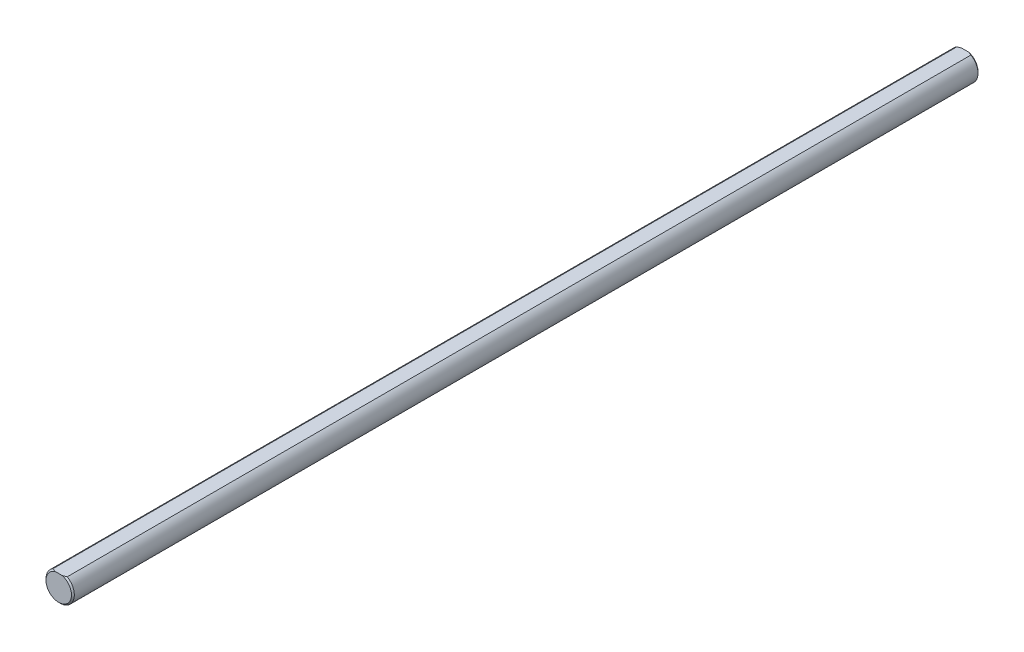
ISO-10303-21;
HEADER;
FILE_DESCRIPTION(('STEP AP214'),'2;1');
FILE_NAME('part.step','',(''),(''),'','','');
FILE_SCHEMA(('AUTOMOTIVE_DESIGN { 1 0 10303 214 1 1 1 1 }'));
ENDSEC;
DATA;
#1=APPLICATION_CONTEXT('core data for automotive mechanical design processes');
#2=APPLICATION_PROTOCOL_DEFINITION('international standard','automotive_design',2000,#1);
#3=PRODUCT_CONTEXT('',#1,'mechanical');
#4=PRODUCT('Part','Part','',(#3));
#5=PRODUCT_RELATED_PRODUCT_CATEGORY('part','',(#4));
#6=PRODUCT_DEFINITION_FORMATION('','',#4);
#7=PRODUCT_DEFINITION_CONTEXT('part definition',#1,'design');
#8=PRODUCT_DEFINITION('design','',#6,#7);
#9=PRODUCT_DEFINITION_SHAPE('','',#8);
#10=(LENGTH_UNIT() NAMED_UNIT(*) SI_UNIT(.MILLI.,.METRE.));
#11=(NAMED_UNIT(*) PLANE_ANGLE_UNIT() SI_UNIT($,.RADIAN.));
#12=(NAMED_UNIT(*) SI_UNIT($,.STERADIAN.) SOLID_ANGLE_UNIT());
#13=UNCERTAINTY_MEASURE_WITH_UNIT(LENGTH_MEASURE(1.E-05),#10,'distance_accuracy_value','');
#14=(GEOMETRIC_REPRESENTATION_CONTEXT(3) GLOBAL_UNCERTAINTY_ASSIGNED_CONTEXT((#13)) GLOBAL_UNIT_ASSIGNED_CONTEXT((#10,
#11,#12)) REPRESENTATION_CONTEXT('',''));
#15=CARTESIAN_POINT('',(0.,0.,0.));
#16=DIRECTION('',(0.,0.,1.));
#17=DIRECTION('',(1.,0.,0.));
#18=AXIS2_PLACEMENT_3D('',#15,#16,#17);
#19=CARTESIAN_POINT('',(0.,0.,152.4));
#20=DIRECTION('',(0.,0.,-1.));
#21=DIRECTION('',(-1.,0.,0.));
#22=AXIS2_PLACEMENT_3D('',#19,#20,#21);
#23=CYLINDRICAL_SURFACE('',#22,4.7625);
#24=DIRECTION('',(0.,0.,1.));
#25=VECTOR('',#24,1.);
#26=CARTESIAN_POINT('',(-2.38125,4.12444598552339,-152.4));
#27=LINE('',#26,#25);
#28=CARTESIAN_POINT('',(-2.38125,4.12444598552339,-151.92375));
#29=VERTEX_POINT('',#28);
#30=CARTESIAN_POINT('',(-2.38125,4.12444598552339,151.92375));
#31=VERTEX_POINT('',#30);
#32=EDGE_CURVE('E84',#29,#31,#27,.T.);
#33=ORIENTED_EDGE('',*,*,#32,.F.);
#34=CARTESIAN_POINT('',(0.,0.,-151.92375));
#35=DIRECTION('',(0.,0.,1.));
#36=DIRECTION('',(1.,0.,0.));
#37=AXIS2_PLACEMENT_3D('',#34,#35,#36);
#38=CIRCLE('',#37,4.7625);
#39=CARTESIAN_POINT('',(2.38125,4.12444598552339,-151.92375));
#40=VERTEX_POINT('',#39);
#41=EDGE_CURVE('E95',#29,#40,#38,.T.);
#42=ORIENTED_EDGE('',*,*,#41,.T.);
#43=DIRECTION('',(0.,0.,1.));
#44=VECTOR('',#43,1.);
#45=CARTESIAN_POINT('',(2.38125,4.12444598552339,-152.4));
#46=LINE('',#45,#44);
#47=CARTESIAN_POINT('',(2.38125,4.12444598552339,151.92375));
#48=VERTEX_POINT('',#47);
#49=EDGE_CURVE('E97',#40,#48,#46,.T.);
#50=ORIENTED_EDGE('',*,*,#49,.T.);
#51=CARTESIAN_POINT('',(0.,0.,151.92375));
#52=DIRECTION('',(0.,0.,1.));
#53=DIRECTION('',(1.,0.,0.));
#54=AXIS2_PLACEMENT_3D('',#51,#52,#53);
#55=CIRCLE('',#54,4.7625);
#56=EDGE_CURVE('E96',#48,#31,#55,.F.);
#57=ORIENTED_EDGE('',*,*,#56,.T.);
#58=EDGE_LOOP('',(#33,#42,#50,#57));
#59=FACE_BOUND('',#58,.T.);
#60=ADVANCED_FACE('F37',(#59),#23,.T.);
#61=CARTESIAN_POINT('',(0.,0.,152.4));
#62=DIRECTION('',(0.,0.,1.));
#63=DIRECTION('',(1.,0.,0.));
#64=AXIS2_PLACEMENT_3D('',#61,#62,#63);
#65=PLANE('',#64);
#66=DIRECTION('',(1.,0.,0.));
#67=VECTOR('',#66,1.);
#68=CARTESIAN_POINT('',(-2.38125,4.12444598552339,152.4));
#69=LINE('',#68,#67);
#70=CARTESIAN_POINT('',(-1.16656949000066,4.12444598552339,152.4));
#71=VERTEX_POINT('',#70);
#72=CARTESIAN_POINT('',(1.16656949000066,4.12444598552339,152.4));
#73=VERTEX_POINT('',#72);
#74=EDGE_CURVE('E142',#71,#73,#69,.T.);
#75=ORIENTED_EDGE('',*,*,#74,.F.);
#76=CARTESIAN_POINT('',(0.,0.,152.4));
#77=DIRECTION('',(0.,0.,1.));
#78=DIRECTION('',(1.,0.,0.));
#79=AXIS2_PLACEMENT_3D('',#76,#77,#78);
#80=CIRCLE('',#79,4.28625000000005);
#81=EDGE_CURVE('E11',#71,#73,#80,.T.);
#82=ORIENTED_EDGE('',*,*,#81,.T.);
#83=EDGE_LOOP('',(#75,#82));
#84=FACE_BOUND('',#83,.T.);
#85=ADVANCED_FACE('F135',(#84),#65,.T.);
#86=CARTESIAN_POINT('',(0.,0.,-152.4));
#87=DIRECTION('',(0.,0.,1.));
#88=DIRECTION('',(1.,0.,0.));
#89=AXIS2_PLACEMENT_3D('',#86,#87,#88);
#90=PLANE('',#89);
#91=DIRECTION('',(1.,0.,0.));
#92=VECTOR('',#91,1.);
#93=CARTESIAN_POINT('',(-2.38125,4.12444598552339,-152.4));
#94=LINE('',#93,#92);
#95=CARTESIAN_POINT('',(-1.16656948999974,4.12444598552339,-152.4));
#96=VERTEX_POINT('',#95);
#97=CARTESIAN_POINT('',(1.16656948999975,4.12444598552339,-152.4));
#98=VERTEX_POINT('',#97);
#99=EDGE_CURVE('E86',#96,#98,#94,.T.);
#100=ORIENTED_EDGE('',*,*,#99,.T.);
#101=CARTESIAN_POINT('',(0.,0.,-152.4));
#102=DIRECTION('',(0.,0.,1.));
#103=DIRECTION('',(1.,0.,0.));
#104=AXIS2_PLACEMENT_3D('',#101,#102,#103);
#105=CIRCLE('',#104,4.2862499999998);
#106=EDGE_CURVE('E46',#98,#96,#105,.F.);
#107=ORIENTED_EDGE('',*,*,#106,.T.);
#108=EDGE_LOOP('',(#100,#107));
#109=FACE_BOUND('',#108,.T.);
#110=ADVANCED_FACE('F116',(#109),#90,.F.);
#111=CARTESIAN_POINT('',(-2.38125,4.12444598552339,-152.4));
#112=DIRECTION('',(0.,-1.,0.));
#113=DIRECTION('',(0.,0.,-1.));
#114=AXIS2_PLACEMENT_3D('',#111,#112,#113);
#115=PLANE('',#114);
#116=ORIENTED_EDGE('',*,*,#49,.F.);
#117=CARTESIAN_POINT('',(2.38125,4.12444598552339,-151.92375));
#118=CARTESIAN_POINT('',(2.28375775048898,4.12444598552339,-151.97248212372));
#119=CARTESIAN_POINT('',(2.18535282357032,4.12444598552339,-152.019452861429));
#120=CARTESIAN_POINT('',(1.98687340615509,4.12444598552339,-152.109038777138));
#121=CARTESIAN_POINT('',(1.8868035583157,4.12444598552339,-152.151664270525));
#122=CARTESIAN_POINT('',(1.68463377003705,4.12444598552339,-152.231988008557));
#123=CARTESIAN_POINT('',(1.58253298554218,4.12444598552339,-152.269684153101));
#124=CARTESIAN_POINT('',(1.37613338518137,4.12444598552339,-152.339373293921));
#125=CARTESIAN_POINT('',(1.2718298149126,4.12444598552339,-152.371352153296));
#126=CARTESIAN_POINT('',(1.16656948999974,4.12444598552339,-152.4));
#127=B_SPLINE_CURVE_WITH_KNOTS('',3,(#117,#118,#119,#120,#121,#122,#123,#124,#125,#126),
.UNSPECIFIED.,.F.,.F.,(4,2,2,2,4),(0.,0.327003853166867,0.65321239484612,0.979559464696401,
1.30670264352163),.UNSPECIFIED.);
#128=EDGE_CURVE('E90',#40,#98,#127,.T.);
#129=ORIENTED_EDGE('',*,*,#128,.T.);
#130=ORIENTED_EDGE('',*,*,#99,.F.);
#131=CARTESIAN_POINT('',(-1.16656948999974,4.12444598552339,-152.4));
#132=CARTESIAN_POINT('',(-1.27182981491261,4.12444598552339,-152.371352153296));
#133=CARTESIAN_POINT('',(-1.37613338518137,4.12444598552339,-152.339373293921));
#134=CARTESIAN_POINT('',(-1.58253298554218,4.12444598552339,-152.269684153101));
#135=CARTESIAN_POINT('',(-1.68463377003705,4.12444598552339,-152.231988008557));
#136=CARTESIAN_POINT('',(-1.8868035583157,4.12444598552339,-152.151664270525));
#137=CARTESIAN_POINT('',(-1.98687340615509,4.12444598552339,-152.109038777138));
#138=CARTESIAN_POINT('',(-2.18535282357032,4.12444598552339,-152.019452861429));
#139=CARTESIAN_POINT('',(-2.28375775048898,4.12444598552339,-151.97248212372));
#140=CARTESIAN_POINT('',(-2.38125,4.12444598552339,-151.92375));
#141=B_SPLINE_CURVE_WITH_KNOTS('',3,(#131,#132,#133,#134,#135,#136,#137,#138,#139,#140),
.UNSPECIFIED.,.F.,.F.,(4,2,2,2,4),(0.,0.327143178825226,0.653490248675506,0.979698790354757,
1.30670264352162),.UNSPECIFIED.);
#142=EDGE_CURVE('E80',#96,#29,#141,.T.);
#143=ORIENTED_EDGE('',*,*,#142,.T.);
#144=ORIENTED_EDGE('',*,*,#32,.T.);
#145=CARTESIAN_POINT('',(-2.38125,4.12444598552339,151.92375));
#146=CARTESIAN_POINT('',(-2.28375775048906,4.12444598552339,151.97248212372));
#147=CARTESIAN_POINT('',(-2.18535282357046,4.12444598552339,152.019452861429));
#148=CARTESIAN_POINT('',(-1.98687340615538,4.12444598552339,152.109038777138));
#149=CARTESIAN_POINT('',(-1.88680355831607,4.12444598552339,152.151664270525));
#150=CARTESIAN_POINT('',(-1.68463377003756,4.12444598552339,152.231988008557));
#151=CARTESIAN_POINT('',(-1.58253298554277,4.12444598552339,152.269684153101));
#152=CARTESIAN_POINT('',(-1.37613338518212,4.12444598552339,152.339373293921));
#153=CARTESIAN_POINT('',(-1.27182981491343,4.12444598552339,152.371352153296));
#154=CARTESIAN_POINT('',(-1.16656949000065,4.12444598552339,152.4));
#155=B_SPLINE_CURVE_WITH_KNOTS('',3,(#145,#146,#147,#148,#149,#150,#151,#152,#153,#154),
.UNSPECIFIED.,.F.,.F.,(4,2,2,2,4),(0.,0.327003853166622,0.653212394845639,0.979559464695683,
1.30670264352067),.UNSPECIFIED.);
#156=EDGE_CURVE('E60',#31,#71,#155,.T.);
#157=ORIENTED_EDGE('',*,*,#156,.T.);
#158=ORIENTED_EDGE('',*,*,#74,.T.);
#159=CARTESIAN_POINT('',(1.16656949000066,4.12444598552339,152.4));
#160=CARTESIAN_POINT('',(1.27182981491343,4.12444598552339,152.371352153296));
#161=CARTESIAN_POINT('',(1.37613338518212,4.12444598552339,152.339373293921));
#162=CARTESIAN_POINT('',(1.58253298554277,4.12444598552339,152.269684153101));
#163=CARTESIAN_POINT('',(1.68463377003757,4.12444598552339,152.231988008557));
#164=CARTESIAN_POINT('',(1.88680355831607,4.12444598552339,152.151664270525));
#165=CARTESIAN_POINT('',(1.98687340615539,4.12444598552339,152.109038777138));
#166=CARTESIAN_POINT('',(2.18535282357047,4.12444598552339,152.019452861429));
#167=CARTESIAN_POINT('',(2.28375775048906,4.12444598552339,151.97248212372));
#168=CARTESIAN_POINT('',(2.38125,4.12444598552339,151.92375));
#169=B_SPLINE_CURVE_WITH_KNOTS('',3,(#159,#160,#161,#162,#163,#164,#165,#166,#167,#168),
.UNSPECIFIED.,.F.,.F.,(4,2,2,2,4),(0.,0.327143178824981,0.653490248675032,0.979698790354048,
1.30670264352067),.UNSPECIFIED.);
#170=EDGE_CURVE('E53',#73,#48,#169,.T.);
#171=ORIENTED_EDGE('',*,*,#170,.T.);
#172=EDGE_LOOP('',(#116,#129,#130,#143,#144,#157,#158,#171));
#173=FACE_BOUND('',#172,.T.);
#174=ADVANCED_FACE('F83',(#173),#115,.F.);
#175=CARTESIAN_POINT('',(0.,0.,-151.92375));
#176=DIRECTION('',(0.,0.,1.));
#177=DIRECTION('',(1.,0.,0.));
#178=AXIS2_PLACEMENT_3D('',#175,#176,#177);
#179=CONICAL_SURFACE('',#178,4.7625,0.785398163397417);
#180=ORIENTED_EDGE('',*,*,#142,.F.);
#181=ORIENTED_EDGE('',*,*,#106,.F.);
#182=ORIENTED_EDGE('',*,*,#128,.F.);
#183=ORIENTED_EDGE('',*,*,#41,.F.);
#184=EDGE_LOOP('',(#180,#181,#182,#183));
#185=FACE_BOUND('',#184,.T.);
#186=ADVANCED_FACE('F99',(#185),#179,.T.);
#187=CARTESIAN_POINT('',(0.,0.,152.4));
#188=DIRECTION('',(0.,0.,-1.));
#189=DIRECTION('',(-1.,0.,0.));
#190=AXIS2_PLACEMENT_3D('',#187,#188,#189);
#191=CONICAL_SURFACE('',#190,4.28625000000005,0.785398163397447);
#192=ORIENTED_EDGE('',*,*,#156,.F.);
#193=ORIENTED_EDGE('',*,*,#56,.F.);
#194=ORIENTED_EDGE('',*,*,#170,.F.);
#195=ORIENTED_EDGE('',*,*,#81,.F.);
#196=EDGE_LOOP('',(#192,#193,#194,#195));
#197=FACE_BOUND('',#196,.T.);
#198=ADVANCED_FACE('F39',(#197),#191,.T.);
#199=CLOSED_SHELL('',(#60,#85,#110,#174,#186,#198));
#200=MANIFOLD_SOLID_BREP('B2',#199);
#201=ADVANCED_BREP_SHAPE_REPRESENTATION('',(#18,#200),#14);
#202=SHAPE_DEFINITION_REPRESENTATION(#9,#201);
ENDSEC;
END-ISO-10303-21;
